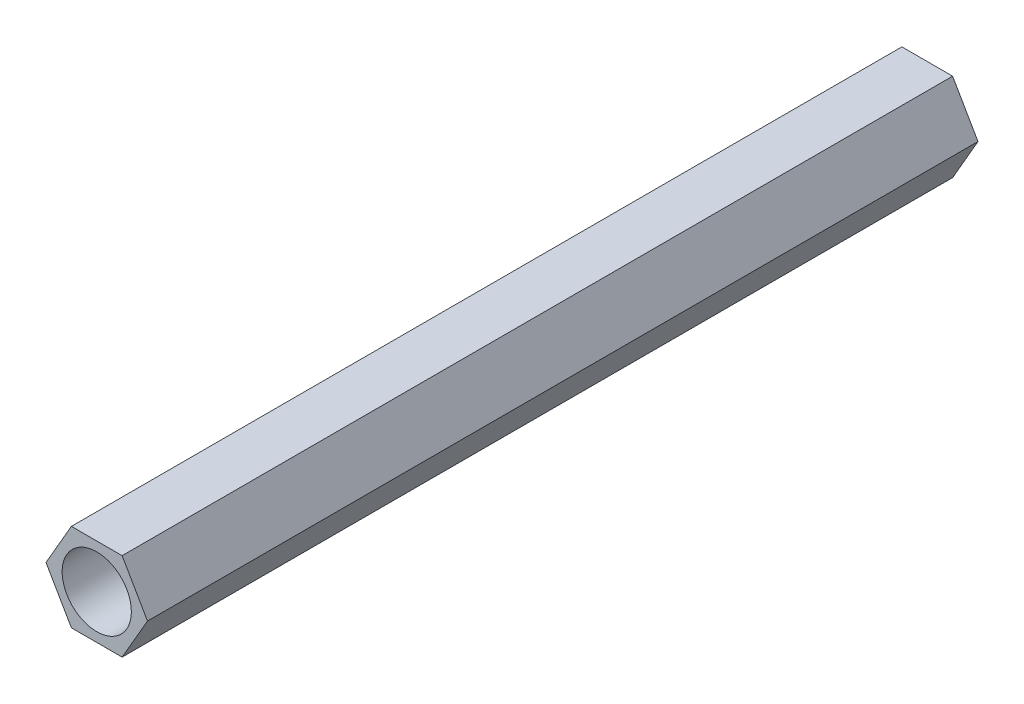
ISO-10303-21;
HEADER;
FILE_DESCRIPTION(('STEP AP214'),'2;1');
FILE_NAME('part.step','',(''),(''),'','','');
FILE_SCHEMA(('AUTOMOTIVE_DESIGN { 1 0 10303 214 1 1 1 1 }'));
ENDSEC;
DATA;
#1=APPLICATION_CONTEXT('core data for automotive mechanical design processes');
#2=APPLICATION_PROTOCOL_DEFINITION('international standard','automotive_design',2000,#1);
#3=PRODUCT_CONTEXT('',#1,'mechanical');
#4=PRODUCT('Part','Part','',(#3));
#5=PRODUCT_RELATED_PRODUCT_CATEGORY('part','',(#4));
#6=PRODUCT_DEFINITION_FORMATION('','',#4);
#7=PRODUCT_DEFINITION_CONTEXT('part definition',#1,'design');
#8=PRODUCT_DEFINITION('design','',#6,#7);
#9=PRODUCT_DEFINITION_SHAPE('','',#8);
#10=(LENGTH_UNIT() NAMED_UNIT(*) SI_UNIT(.MILLI.,.METRE.));
#11=(NAMED_UNIT(*) PLANE_ANGLE_UNIT() SI_UNIT($,.RADIAN.));
#12=(NAMED_UNIT(*) SI_UNIT($,.STERADIAN.) SOLID_ANGLE_UNIT());
#13=UNCERTAINTY_MEASURE_WITH_UNIT(LENGTH_MEASURE(1.E-05),#10,'distance_accuracy_value','');
#14=(GEOMETRIC_REPRESENTATION_CONTEXT(3) GLOBAL_UNCERTAINTY_ASSIGNED_CONTEXT((#13)) GLOBAL_UNIT_ASSIGNED_CONTEXT((#10,
#11,#12)) REPRESENTATION_CONTEXT('',''));
#15=CARTESIAN_POINT('',(0.,0.,0.));
#16=DIRECTION('',(0.,0.,1.));
#17=DIRECTION('',(1.,0.,0.));
#18=AXIS2_PLACEMENT_3D('',#15,#16,#17);
#19=CARTESIAN_POINT('',(0.,0.,60.));
#20=DIRECTION('',(0.,0.,1.));
#21=DIRECTION('',(1.,0.,0.));
#22=AXIS2_PLACEMENT_3D('',#19,#20,#21);
#23=PLANE('',#22);
#24=DIRECTION('',(0.499999999999995,0.866025403784442,0.));
#25=VECTOR('',#24,1.);
#26=CARTESIAN_POINT('',(1.8330871046771,-3.17499999999998,60.));
#27=LINE('',#26,#25);
#28=CARTESIAN_POINT('',(1.8330871046771,-3.17499999999998,60.));
#29=VERTEX_POINT('',#28);
#30=CARTESIAN_POINT('',(3.66617420935413,0.,60.));
#31=VERTEX_POINT('',#30);
#32=EDGE_CURVE('E128',#29,#31,#27,.T.);
#33=ORIENTED_EDGE('',*,*,#32,.T.);
#34=DIRECTION('',(-0.500000000000001,0.866025403784438,0.));
#35=VECTOR('',#34,1.);
#36=CARTESIAN_POINT('',(3.66617420935413,0.,60.));
#37=LINE('',#36,#35);
#38=CARTESIAN_POINT('',(1.83308710467706,3.17500000000001,60.));
#39=VERTEX_POINT('',#38);
#40=EDGE_CURVE('E86',#31,#39,#37,.T.);
#41=ORIENTED_EDGE('',*,*,#40,.T.);
#42=DIRECTION('',(-1.,0.,0.));
#43=VECTOR('',#42,1.);
#44=CARTESIAN_POINT('',(1.83308710467706,3.17500000000001,60.));
#45=LINE('',#44,#43);
#46=CARTESIAN_POINT('',(-1.83308710467708,3.17499999999999,60.));
#47=VERTEX_POINT('',#46);
#48=EDGE_CURVE('E99',#39,#47,#45,.T.);
#49=ORIENTED_EDGE('',*,*,#48,.T.);
#50=DIRECTION('',(-0.499999999999995,-0.866025403784442,0.));
#51=VECTOR('',#50,1.);
#52=CARTESIAN_POINT('',(-1.83308710467708,3.17499999999999,60.));
#53=LINE('',#52,#51);
#54=CARTESIAN_POINT('',(-3.66617420935412,0.,60.));
#55=VERTEX_POINT('',#54);
#56=EDGE_CURVE('E93',#47,#55,#53,.T.);
#57=ORIENTED_EDGE('',*,*,#56,.T.);
#58=DIRECTION('',(0.500000000000007,-0.866025403784435,0.));
#59=VECTOR('',#58,1.);
#60=CARTESIAN_POINT('',(-3.66617420935412,0.,60.));
#61=LINE('',#60,#59);
#62=CARTESIAN_POINT('',(-1.83308710467703,-3.17500000000002,60.));
#63=VERTEX_POINT('',#62);
#64=EDGE_CURVE('E97',#55,#63,#61,.T.);
#65=ORIENTED_EDGE('',*,*,#64,.T.);
#66=DIRECTION('',(1.,0.,0.));
#67=VECTOR('',#66,1.);
#68=CARTESIAN_POINT('',(-1.83308710467703,-3.17500000000002,60.));
#69=LINE('',#68,#67);
#70=EDGE_CURVE('E49',#63,#29,#69,.T.);
#71=ORIENTED_EDGE('',*,*,#70,.T.);
#72=EDGE_LOOP('',(#33,#41,#49,#57,#65,#71));
#73=FACE_BOUND('',#72,.T.);
#74=CARTESIAN_POINT('',(0.,0.,60.));
#75=DIRECTION('',(0.,0.,1.));
#76=DIRECTION('',(1.,0.,0.));
#77=AXIS2_PLACEMENT_3D('',#74,#75,#76);
#78=CIRCLE('',#77,2.5);
#79=CARTESIAN_POINT('',(2.5,0.,60.));
#80=VERTEX_POINT('',#79);
#81=EDGE_CURVE('E121',#80,#80,#78,.T.);
#82=ORIENTED_EDGE('',*,*,#81,.F.);
#83=EDGE_LOOP('',(#82));
#84=FACE_BOUND('',#83,.T.);
#85=ADVANCED_FACE('F32',(#73,#84),#23,.T.);
#86=CARTESIAN_POINT('',(0.,0.,0.));
#87=DIRECTION('',(0.,0.,1.));
#88=DIRECTION('',(1.,0.,0.));
#89=AXIS2_PLACEMENT_3D('',#86,#87,#88);
#90=PLANE('',#89);
#91=DIRECTION('',(0.499999999999995,0.866025403784442,0.));
#92=VECTOR('',#91,1.);
#93=CARTESIAN_POINT('',(1.8330871046771,-3.17499999999998,0.));
#94=LINE('',#93,#92);
#95=CARTESIAN_POINT('',(1.8330871046771,-3.17499999999998,0.));
#96=VERTEX_POINT('',#95);
#97=CARTESIAN_POINT('',(3.66617420935413,0.,0.));
#98=VERTEX_POINT('',#97);
#99=EDGE_CURVE('E117',#96,#98,#94,.T.);
#100=ORIENTED_EDGE('',*,*,#99,.F.);
#101=DIRECTION('',(1.,0.,0.));
#102=VECTOR('',#101,1.);
#103=CARTESIAN_POINT('',(-1.83308710467703,-3.17500000000002,0.));
#104=LINE('',#103,#102);
#105=CARTESIAN_POINT('',(-1.83308710467703,-3.17500000000002,0.));
#106=VERTEX_POINT('',#105);
#107=EDGE_CURVE('E78',#106,#96,#104,.T.);
#108=ORIENTED_EDGE('',*,*,#107,.F.);
#109=DIRECTION('',(0.500000000000007,-0.866025403784435,0.));
#110=VECTOR('',#109,1.);
#111=CARTESIAN_POINT('',(-3.66617420935412,0.,0.));
#112=LINE('',#111,#110);
#113=CARTESIAN_POINT('',(-3.66617420935412,0.,0.));
#114=VERTEX_POINT('',#113);
#115=EDGE_CURVE('E72',#114,#106,#112,.T.);
#116=ORIENTED_EDGE('',*,*,#115,.F.);
#117=DIRECTION('',(-0.499999999999995,-0.866025403784442,0.));
#118=VECTOR('',#117,1.);
#119=CARTESIAN_POINT('',(-1.83308710467708,3.17499999999999,0.));
#120=LINE('',#119,#118);
#121=CARTESIAN_POINT('',(-1.83308710467708,3.17499999999999,0.));
#122=VERTEX_POINT('',#121);
#123=EDGE_CURVE('E107',#122,#114,#120,.T.);
#124=ORIENTED_EDGE('',*,*,#123,.F.);
#125=DIRECTION('',(-1.,0.,0.));
#126=VECTOR('',#125,1.);
#127=CARTESIAN_POINT('',(1.83308710467706,3.17500000000001,0.));
#128=LINE('',#127,#126);
#129=CARTESIAN_POINT('',(1.83308710467706,3.17500000000001,0.));
#130=VERTEX_POINT('',#129);
#131=EDGE_CURVE('E123',#130,#122,#128,.T.);
#132=ORIENTED_EDGE('',*,*,#131,.F.);
#133=DIRECTION('',(-0.500000000000001,0.866025403784438,0.));
#134=VECTOR('',#133,1.);
#135=CARTESIAN_POINT('',(3.66617420935413,0.,0.));
#136=LINE('',#135,#134);
#137=EDGE_CURVE('E120',#98,#130,#136,.T.);
#138=ORIENTED_EDGE('',*,*,#137,.F.);
#139=EDGE_LOOP('',(#100,#108,#116,#124,#132,#138));
#140=FACE_BOUND('',#139,.T.);
#141=CARTESIAN_POINT('',(0.,0.,0.));
#142=DIRECTION('',(0.,0.,1.));
#143=DIRECTION('',(1.,0.,0.));
#144=AXIS2_PLACEMENT_3D('',#141,#142,#143);
#145=CIRCLE('',#144,2.5);
#146=CARTESIAN_POINT('',(2.5,0.,0.));
#147=VERTEX_POINT('',#146);
#148=EDGE_CURVE('E221',#147,#147,#145,.T.);
#149=ORIENTED_EDGE('',*,*,#148,.T.);
#150=EDGE_LOOP('',(#149));
#151=FACE_BOUND('',#150,.T.);
#152=ADVANCED_FACE('F137',(#140,#151),#90,.F.);
#153=CARTESIAN_POINT('',(1.8330871046771,-3.17499999999998,60.));
#154=DIRECTION('',(-0.866025403784442,0.499999999999995,0.));
#155=DIRECTION('',(-0.499999999999995,-0.866025403784442,0.));
#156=AXIS2_PLACEMENT_3D('',#153,#154,#155);
#157=PLANE('',#156);
#158=ORIENTED_EDGE('',*,*,#99,.T.);
#159=DIRECTION('',(0.,0.,-1.));
#160=VECTOR('',#159,1.);
#161=CARTESIAN_POINT('',(3.66617420935413,0.,60.));
#162=LINE('',#161,#160);
#163=EDGE_CURVE('E11',#31,#98,#162,.T.);
#164=ORIENTED_EDGE('',*,*,#163,.F.);
#165=ORIENTED_EDGE('',*,*,#32,.F.);
#166=DIRECTION('',(0.,0.,-1.));
#167=VECTOR('',#166,1.);
#168=CARTESIAN_POINT('',(1.8330871046771,-3.17499999999998,60.));
#169=LINE('',#168,#167);
#170=EDGE_CURVE('E113',#29,#96,#169,.T.);
#171=ORIENTED_EDGE('',*,*,#170,.T.);
#172=EDGE_LOOP('',(#158,#164,#165,#171));
#173=FACE_BOUND('',#172,.T.);
#174=ADVANCED_FACE('F34',(#173),#157,.F.);
#175=CARTESIAN_POINT('',(3.66617420935413,0.,60.));
#176=DIRECTION('',(-0.866025403784438,-0.500000000000001,0.));
#177=DIRECTION('',(0.500000000000001,-0.866025403784438,0.));
#178=AXIS2_PLACEMENT_3D('',#175,#176,#177);
#179=PLANE('',#178);
#180=ORIENTED_EDGE('',*,*,#137,.T.);
#181=DIRECTION('',(0.,0.,-1.));
#182=VECTOR('',#181,1.);
#183=CARTESIAN_POINT('',(1.83308710467706,3.17500000000001,60.));
#184=LINE('',#183,#182);
#185=EDGE_CURVE('E41',#39,#130,#184,.T.);
#186=ORIENTED_EDGE('',*,*,#185,.F.);
#187=ORIENTED_EDGE('',*,*,#40,.F.);
#188=ORIENTED_EDGE('',*,*,#163,.T.);
#189=EDGE_LOOP('',(#180,#186,#187,#188));
#190=FACE_BOUND('',#189,.T.);
#191=ADVANCED_FACE('F162',(#190),#179,.F.);
#192=CARTESIAN_POINT('',(1.83308710467706,3.17500000000001,60.));
#193=DIRECTION('',(0.,-1.,0.));
#194=DIRECTION('',(1.,0.,0.));
#195=AXIS2_PLACEMENT_3D('',#192,#193,#194);
#196=PLANE('',#195);
#197=ORIENTED_EDGE('',*,*,#131,.T.);
#198=DIRECTION('',(0.,0.,-1.));
#199=VECTOR('',#198,1.);
#200=CARTESIAN_POINT('',(-1.83308710467708,3.17499999999999,60.));
#201=LINE('',#200,#199);
#202=EDGE_CURVE('E108',#47,#122,#201,.T.);
#203=ORIENTED_EDGE('',*,*,#202,.F.);
#204=ORIENTED_EDGE('',*,*,#48,.F.);
#205=ORIENTED_EDGE('',*,*,#185,.T.);
#206=EDGE_LOOP('',(#197,#203,#204,#205));
#207=FACE_BOUND('',#206,.T.);
#208=ADVANCED_FACE('F134',(#207),#196,.F.);
#209=CARTESIAN_POINT('',(-1.83308710467708,3.17499999999999,60.));
#210=DIRECTION('',(0.866025403784442,-0.499999999999995,0.));
#211=DIRECTION('',(0.499999999999995,0.866025403784442,0.));
#212=AXIS2_PLACEMENT_3D('',#209,#210,#211);
#213=PLANE('',#212);
#214=ORIENTED_EDGE('',*,*,#123,.T.);
#215=DIRECTION('',(0.,0.,-1.));
#216=VECTOR('',#215,1.);
#217=CARTESIAN_POINT('',(-3.66617420935412,0.,60.));
#218=LINE('',#217,#216);
#219=EDGE_CURVE('E104',#55,#114,#218,.T.);
#220=ORIENTED_EDGE('',*,*,#219,.F.);
#221=ORIENTED_EDGE('',*,*,#56,.F.);
#222=ORIENTED_EDGE('',*,*,#202,.T.);
#223=EDGE_LOOP('',(#214,#220,#221,#222));
#224=FACE_BOUND('',#223,.T.);
#225=ADVANCED_FACE('F105',(#224),#213,.F.);
#226=CARTESIAN_POINT('',(-3.66617420935412,0.,60.));
#227=DIRECTION('',(0.866025403784435,0.500000000000007,0.));
#228=DIRECTION('',(-0.500000000000007,0.866025403784435,0.));
#229=AXIS2_PLACEMENT_3D('',#226,#227,#228);
#230=PLANE('',#229);
#231=ORIENTED_EDGE('',*,*,#115,.T.);
#232=DIRECTION('',(0.,0.,-1.));
#233=VECTOR('',#232,1.);
#234=CARTESIAN_POINT('',(-1.83308710467703,-3.17500000000002,60.));
#235=LINE('',#234,#233);
#236=EDGE_CURVE('E109',#63,#106,#235,.T.);
#237=ORIENTED_EDGE('',*,*,#236,.F.);
#238=ORIENTED_EDGE('',*,*,#64,.F.);
#239=ORIENTED_EDGE('',*,*,#219,.T.);
#240=EDGE_LOOP('',(#231,#237,#238,#239));
#241=FACE_BOUND('',#240,.T.);
#242=ADVANCED_FACE('F111',(#241),#230,.F.);
#243=CARTESIAN_POINT('',(-1.83308710467703,-3.17500000000002,60.));
#244=DIRECTION('',(0.,1.,0.));
#245=DIRECTION('',(-1.,0.,0.));
#246=AXIS2_PLACEMENT_3D('',#243,#244,#245);
#247=PLANE('',#246);
#248=ORIENTED_EDGE('',*,*,#107,.T.);
#249=ORIENTED_EDGE('',*,*,#170,.F.);
#250=ORIENTED_EDGE('',*,*,#70,.F.);
#251=ORIENTED_EDGE('',*,*,#236,.T.);
#252=EDGE_LOOP('',(#248,#249,#250,#251));
#253=FACE_BOUND('',#252,.T.);
#254=ADVANCED_FACE('F142',(#253),#247,.F.);
#255=CARTESIAN_POINT('',(0.,0.,60.));
#256=DIRECTION('',(0.,0.,-1.));
#257=DIRECTION('',(-1.,0.,0.));
#258=AXIS2_PLACEMENT_3D('',#255,#256,#257);
#259=CYLINDRICAL_SURFACE('',#258,2.5);
#260=ORIENTED_EDGE('',*,*,#81,.T.);
#261=EDGE_LOOP('',(#260));
#262=FACE_BOUND('',#261,.T.);
#263=ORIENTED_EDGE('',*,*,#148,.F.);
#264=EDGE_LOOP('',(#263));
#265=FACE_BOUND('',#264,.T.);
#266=ADVANCED_FACE('F144',(#262,#265),#259,.F.);
#267=CLOSED_SHELL('',(#85,#152,#174,#191,#208,#225,#242,#254,#266));
#268=MANIFOLD_SOLID_BREP('B2',#267);
#269=ADVANCED_BREP_SHAPE_REPRESENTATION('',(#18,#268),#14);
#270=SHAPE_DEFINITION_REPRESENTATION(#9,#269);
ENDSEC;
END-ISO-10303-21;
